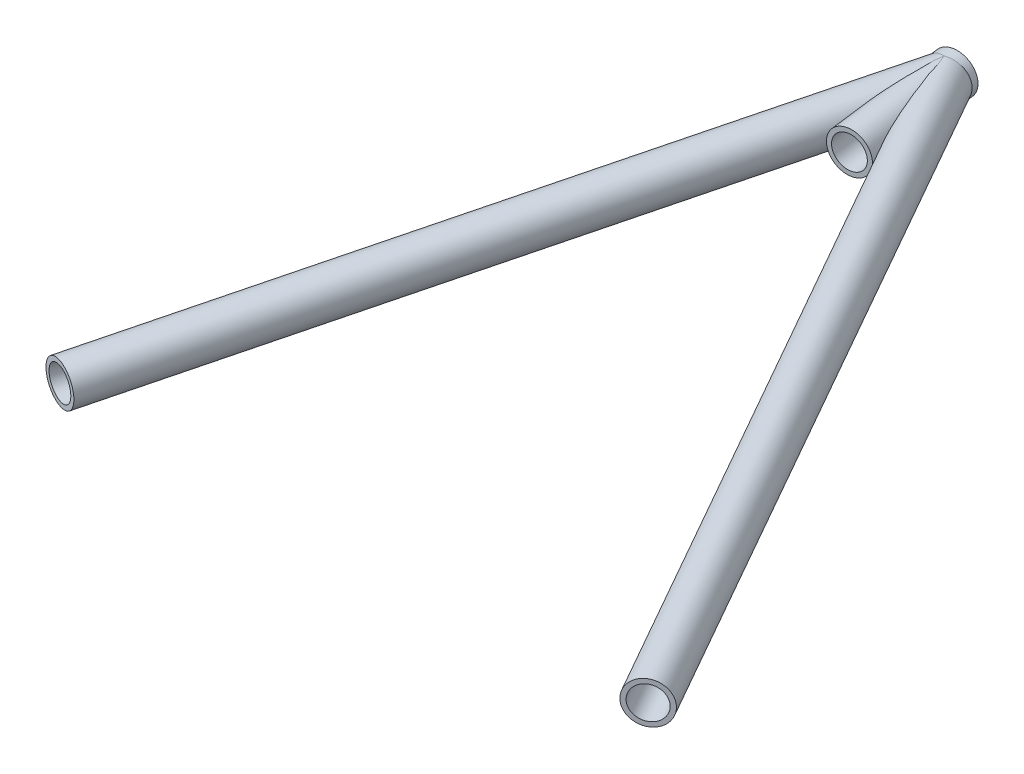
ISO-10303-21;
HEADER;
FILE_DESCRIPTION(('STEP AP214'),'2;1');
FILE_NAME('part.step','',(''),(''),'','','');
FILE_SCHEMA(('AUTOMOTIVE_DESIGN { 1 0 10303 214 1 1 1 1 }'));
ENDSEC;
DATA;
#1=APPLICATION_CONTEXT('core data for automotive mechanical design processes');
#2=APPLICATION_PROTOCOL_DEFINITION('international standard','automotive_design',2000,#1);
#3=PRODUCT_CONTEXT('',#1,'mechanical');
#4=PRODUCT('Part','Part','',(#3));
#5=PRODUCT_RELATED_PRODUCT_CATEGORY('part','',(#4));
#6=PRODUCT_DEFINITION_FORMATION('','',#4);
#7=PRODUCT_DEFINITION_CONTEXT('part definition',#1,'design');
#8=PRODUCT_DEFINITION('design','',#6,#7);
#9=PRODUCT_DEFINITION_SHAPE('','',#8);
#10=(LENGTH_UNIT() NAMED_UNIT(*) SI_UNIT(.MILLI.,.METRE.));
#11=(NAMED_UNIT(*) PLANE_ANGLE_UNIT() SI_UNIT($,.RADIAN.));
#12=(NAMED_UNIT(*) SI_UNIT($,.STERADIAN.) SOLID_ANGLE_UNIT());
#13=UNCERTAINTY_MEASURE_WITH_UNIT(LENGTH_MEASURE(1.E-05),#10,'distance_accuracy_value','');
#14=(GEOMETRIC_REPRESENTATION_CONTEXT(3) GLOBAL_UNCERTAINTY_ASSIGNED_CONTEXT((#13)) GLOBAL_UNIT_ASSIGNED_CONTEXT((#10,
#11,#12)) REPRESENTATION_CONTEXT('',''));
#15=CARTESIAN_POINT('',(0.,0.,0.));
#16=DIRECTION('',(0.,0.,1.));
#17=DIRECTION('',(1.,0.,0.));
#18=AXIS2_PLACEMENT_3D('',#15,#16,#17);
#19=CARTESIAN_POINT('',(3.75423528508093,133.137476358284,-665.631869893479));
#20=DIRECTION('',(0.49375074260803,-0.000241320421330066,0.86960344177014));
#21=DIRECTION('',(0.869603467091057,0.,-0.493750756984952));
#22=AXIS2_PLACEMENT_3D('',#19,#20,#21);
#23=CYLINDRICAL_SURFACE('',#22,7.4168);
#24=CARTESIAN_POINT('',(182.718724008719,133.050007556528,-350.436120461955));
#25=DIRECTION('',(-0.49375074260803,0.000241320421330099,-0.86960344177014));
#26=DIRECTION('',(-0.869603467091057,0.,0.493750756984952));
#27=AXIS2_PLACEMENT_3D('',#24,#25,#26);
#28=CIRCLE('',#27,7.4168);
#29=CARTESIAN_POINT('',(176.269049013998,133.050007556528,-346.774069847549));
#30=VERTEX_POINT('',#29);
#31=EDGE_CURVE('E107',#30,#30,#28,.T.);
#32=ORIENTED_EDGE('',*,*,#31,.F.);
#33=EDGE_LOOP('',(#32));
#34=FACE_BOUND('',#33,.T.);
#35=CARTESIAN_POINT('',(13.6086546072393,133.135812291246,-663.297418366241));
#36=CARTESIAN_POINT('',(13.6102435157583,132.943696286205,-663.294620419258));
#37=CARTESIAN_POINT('',(13.6066690576741,132.751629390176,-663.285786293646));
#38=CARTESIAN_POINT('',(13.5893625437771,132.368906550424,-663.255934631927));
#39=CARTESIAN_POINT('',(13.5756307597827,132.178250569081,-663.234917421853));
#40=CARTESIAN_POINT('',(13.5383840501864,131.799686158064,-663.18052162104));
#41=CARTESIAN_POINT('',(13.5148696740601,131.611777574685,-663.147143724597));
#42=CARTESIAN_POINT('',(13.4586480537573,131.240035038748,-663.067787849124));
#43=CARTESIAN_POINT('',(13.4259407536838,131.056201110973,-663.02180979348));
#44=CARTESIAN_POINT('',(13.3520880992867,130.693630260555,-662.91687980293));
#45=CARTESIAN_POINT('',(13.3109275200954,130.514903206723,-662.857904444888));
#46=CARTESIAN_POINT('',(13.2212805452743,130.16425714513,-662.726738906455));
#47=CARTESIAN_POINT('',(13.1727941403516,129.992338146004,-662.654548709301));
#48=CARTESIAN_POINT('',(13.0698554429603,129.656731838677,-662.496738700705));
#49=CARTESIAN_POINT('',(13.0154057517197,129.493040986401,-662.411124737827));
#50=CARTESIAN_POINT('',(12.9021198522644,129.175119576387,-662.226306344621));
#51=CARTESIAN_POINT('',(12.8432838294249,129.020888619356,-662.127102488481));
#52=CARTESIAN_POINT('',(12.7249114712971,128.7276943423,-661.918441342211));
#53=CARTESIAN_POINT('',(12.6654530788384,128.588406347137,-661.809396079809));
#54=CARTESIAN_POINT('',(12.5459386252434,128.320775840413,-661.578909036197));
#55=CARTESIAN_POINT('',(12.4858825886566,128.192432881314,-661.457467762301));
#56=CARTESIAN_POINT('',(12.3670414906169,127.947432884083,-661.202867662702));
#57=CARTESIAN_POINT('',(12.308255893457,127.830770841963,-661.069713900832));
#58=CARTESIAN_POINT('',(12.193675505941,127.609438879757,-660.792603609228));
#59=CARTESIAN_POINT('',(12.1378806783114,127.504768810198,-660.648647214179));
#60=CARTESIAN_POINT('',(12.0330497537361,127.311585644815,-660.357470136293));
#61=CARTESIAN_POINT('',(11.9838277485131,127.222576941279,-660.210643957389));
#62=CARTESIAN_POINT('',(11.8905270447521,127.055232389319,-659.909497466283));
#63=CARTESIAN_POINT('',(11.8464481329878,126.976896098409,-659.755177465141));
#64=CARTESIAN_POINT('',(11.7641118296804,126.830303226896,-659.440347613243));
#65=CARTESIAN_POINT('',(11.7258543455774,126.76204648603,-659.279837860954));
#66=CARTESIAN_POINT('',(11.6554962190303,126.634828071231,-658.953876245638));
#67=CARTESIAN_POINT('',(11.6233963345776,126.575867541806,-658.788423777063));
#68=CARTESIAN_POINT('',(11.5450717749549,126.427877832954,-658.33609731047));
#69=CARTESIAN_POINT('',(11.5047637170453,126.346819050203,-658.045568590235));
#70=CARTESIAN_POINT('',(11.4412056524005,126.204598993557,-657.457846524422));
#71=CARTESIAN_POINT('',(11.4179684539771,126.143452679151,-657.160648346671));
#72=CARTESIAN_POINT('',(11.3865566881718,126.036870591985,-656.561411265903));
#73=CARTESIAN_POINT('',(11.3784473252225,125.991503510962,-656.259357042143));
#74=CARTESIAN_POINT('',(11.3761141923393,125.933075842372,-655.805129853787));
#75=CARTESIAN_POINT('',(11.3769743384554,125.915205199458,-655.653546370845));
#76=CARTESIAN_POINT('',(11.381710960775,125.88233550764,-655.350111598786));
#77=CARTESIAN_POINT('',(11.3855874493409,125.867336470506,-655.198260308574));
#78=CARTESIAN_POINT('',(11.3993431256962,125.831479250857,-654.801059677835));
#79=CARTESIAN_POINT('',(11.4114472237281,125.812684955806,-654.555600404177));
#80=CARTESIAN_POINT('',(11.4419305208802,125.780748821526,-654.06468918603));
#81=CARTESIAN_POINT('',(11.4603106197901,125.767607793416,-653.819237247642));
#82=CARTESIAN_POINT('',(11.5025320670153,125.746152432103,-653.328474457607));
#83=CARTESIAN_POINT('',(11.5263761840825,125.737840553524,-653.083163740916));
#84=CARTESIAN_POINT('',(11.5788145912336,125.725405955124,-652.592938514377));
#85=CARTESIAN_POINT('',(11.6074091896892,125.721283507379,-652.348024031294));
#86=CARTESIAN_POINT('',(11.6995159018464,125.714388202832,-651.612928002518));
#87=CARTESIAN_POINT('',(11.7692529026552,125.717129458216,-651.12346900276));
#88=CARTESIAN_POINT('',(11.921368028926,125.734329579169,-650.146927999857));
#89=CARTESIAN_POINT('',(12.0037429282855,125.748785458344,-649.659845422728));
#90=CARTESIAN_POINT('',(12.1786900475808,125.787685297371,-648.685884922059));
#91=CARTESIAN_POINT('',(12.2713023908143,125.812169653435,-648.199015893255));
#92=CARTESIAN_POINT('',(12.4643235736586,125.869992358011,-647.22734302503));
#93=CARTESIAN_POINT('',(12.5647328440914,125.903331196027,-646.742539301293));
#94=CARTESIAN_POINT('',(12.771598946191,125.9781577449,-645.775528433244));
#95=CARTESIAN_POINT('',(12.878047704712,126.019634751546,-645.293318723905));
#96=CARTESIAN_POINT('',(13.0958727535896,126.11045505788,-644.330777891784));
#97=CARTESIAN_POINT('',(13.2072489120966,126.159798147176,-643.85044671911));
#98=CARTESIAN_POINT('',(13.4948496122562,126.294898520002,-642.633950000163));
#99=CARTESIAN_POINT('',(13.6737611085542,126.385975395546,-641.899005148523));
#100=CARTESIAN_POINT('',(14.0381924208502,126.587411388771,-640.433154303958));
#101=CARTESIAN_POINT('',(14.2237142358585,126.697776379405,-639.702249611332));
#102=CARTESIAN_POINT('',(14.5050182438505,126.879192564816,-638.610583869734));
#103=CARTESIAN_POINT('',(14.5991387665726,126.942197445056,-638.24804609261));
#104=CARTESIAN_POINT('',(14.7882467543667,127.073947064027,-637.524244307809));
#105=CARTESIAN_POINT('',(14.8832342038424,127.14269169968,-637.162980277378));
#106=CARTESIAN_POINT('',(15.0738266780298,127.286421605985,-636.441937517069));
#107=CARTESIAN_POINT('',(15.1694315728763,127.361405601385,-636.082158499373));
#108=CARTESIAN_POINT('',(15.361041554355,127.518298380359,-635.364228324397));
#109=CARTESIAN_POINT('',(15.4570466304916,127.600206983393,-635.006077124933));
#110=CARTESIAN_POINT('',(15.6695095433893,127.789938554064,-634.216212032073));
#111=CARTESIAN_POINT('',(15.7860037127206,127.899580659242,-633.784940831252));
#112=CARTESIAN_POINT('',(16.018720723797,128.1324063551,-632.925876710485));
#113=CARTESIAN_POINT('',(16.1349435052178,128.255592708991,-632.498084519493));
#114=CARTESIAN_POINT('',(16.3666326044546,128.518727638981,-631.646517396067));
#115=CARTESIAN_POINT('',(16.4820972480334,128.658705094366,-631.222750777843));
#116=CARTESIAN_POINT('',(16.653762249178,128.884588031495,-630.59248495956));
#117=CARTESIAN_POINT('',(16.710718820979,128.962520206554,-630.383329595457));
#118=CARTESIAN_POINT('',(16.8239361408098,129.124552061024,-629.967239242773));
#119=CARTESIAN_POINT('',(16.8801969495779,129.20865119757,-629.760304060589));
#120=CARTESIAN_POINT('',(16.9920135768224,129.384461478673,-629.348379894913));
#121=CARTESIAN_POINT('',(17.0475653934524,129.476203393559,-629.143402887426));
#122=CARTESIAN_POINT('',(17.1573801861085,129.668481490551,-628.737133886553));
#123=CARTESIAN_POINT('',(17.211642701339,129.769020758456,-628.535843216385));
#124=CARTESIAN_POINT('',(17.3181130413428,129.98046060205,-628.139222305527));
#125=CARTESIAN_POINT('',(17.3703279500728,130.091319948049,-627.943872160899));
#126=CARTESIAN_POINT('',(17.4720539341331,130.326435860247,-627.560751266634));
#127=CARTESIAN_POINT('',(17.5215673717822,130.450680429341,-627.372973933643));
#128=CARTESIAN_POINT('',(17.6021038692364,130.676436552347,-627.064124360761));
#129=CARTESIAN_POINT('',(17.6341879406363,130.773448653534,-626.940062923778));
#130=CARTESIAN_POINT('',(17.6955860126308,130.978126094349,-626.699782509526));
#131=CARTESIAN_POINT('',(17.7248951536827,131.085809470916,-626.583577388607));
#132=CARTESIAN_POINT('',(17.7796688606891,131.315154114233,-626.362044988811));
#133=CARTESIAN_POINT('',(17.8050911311566,131.436946835604,-626.256840847838));
#134=CARTESIAN_POINT('',(17.8495158236233,131.695934674998,-626.065686785233));
#135=CARTESIAN_POINT('',(17.8685387687971,131.833078637288,-625.979675614789));
#136=CARTESIAN_POINT('',(17.8917115495539,132.06918836183,-625.863849875242));
#137=CARTESIAN_POINT('',(17.8987614568092,132.163400174659,-625.825030027491));
#138=CARTESIAN_POINT('',(17.9081851545971,132.356888165458,-625.76230046231));
#139=CARTESIAN_POINT('',(17.9105655117314,132.456157029916,-625.738369839166));
#140=CARTESIAN_POINT('',(17.9100284143125,132.658054018629,-625.707766460941));
#141=CARTESIAN_POINT('',(17.9070758689609,132.760699998131,-625.701208721281));
#142=CARTESIAN_POINT('',(17.8957781926082,132.965260004829,-625.706322989759));
#143=CARTESIAN_POINT('',(17.8874304624642,133.067173655285,-625.718003788199));
#144=CARTESIAN_POINT('',(17.866778754469,133.259840862116,-625.75645426341));
#145=CARTESIAN_POINT('',(17.8548038066008,133.350869004817,-625.782074044116));
#146=CARTESIAN_POINT('',(17.8275607639484,133.528119823033,-625.845168348178));
#147=CARTESIAN_POINT('',(17.8122916199545,133.614340956468,-625.882646650282));
#148=CARTESIAN_POINT('',(17.7661235975256,133.847697926776,-626.000401462534));
#149=CARTESIAN_POINT('',(17.7324233318203,133.988998526671,-626.091066180696));
#150=CARTESIAN_POINT('',(17.6601337750247,134.255952832412,-626.291528389755));
#151=CARTESIAN_POINT('',(17.6215261903194,134.381544310314,-626.401398080043));
#152=CARTESIAN_POINT('',(17.5296122700668,134.654552523155,-626.667403026716));
#153=CARTESIAN_POINT('',(17.4753164567288,134.797563661048,-626.827655410108));
#154=CARTESIAN_POINT('',(17.3639206150107,135.067085956773,-627.160745879943));
#155=CARTESIAN_POINT('',(17.3068152181757,135.193563692967,-627.333608391557));
#156=CARTESIAN_POINT('',(17.1906783077242,135.434160532985,-627.688378364864));
#157=CARTESIAN_POINT('',(17.1316385753243,135.548214522415,-627.870326815258));
#158=CARTESIAN_POINT('',(17.0125987828536,135.76581525633,-628.239779192347));
#159=CARTESIAN_POINT('',(16.9525996845245,135.869371842787,-628.427277698333));
#160=CARTESIAN_POINT('',(16.8379452532912,136.058167503616,-628.787669785946));
#161=CARTESIAN_POINT('',(16.7833500823083,136.144204668453,-628.960167642796));
#162=CARTESIAN_POINT('',(16.6738167086596,136.310444558941,-629.307852852936));
#163=CARTESIAN_POINT('',(16.618878472766,136.390646709616,-629.483040469218));
#164=CARTESIAN_POINT('',(16.4537000312348,136.623820484157,-630.011977159066));
#165=CARTESIAN_POINT('',(16.3431459408628,136.769279390334,-630.368943134666));
#166=CARTESIAN_POINT('',(16.1216677789608,137.045002209726,-631.089425612174));
#167=CARTESIAN_POINT('',(16.0107434203679,137.175233188439,-631.452954418302));
#168=CARTESIAN_POINT('',(15.7891462248987,137.423135381394,-632.184369923435));
#169=CARTESIAN_POINT('',(15.678473416169,137.540805251908,-632.552257084008));
#170=CARTESIAN_POINT('',(15.4574366681595,137.765918076101,-633.292223000904));
#171=CARTESIAN_POINT('',(15.3470740340911,137.873336762449,-633.664309480258));
#172=CARTESIAN_POINT('',(15.127150616958,138.079163288941,-634.411214893228));
#173=CARTESIAN_POINT('',(15.0175898788865,138.177570626984,-634.786033977847));
#174=CARTESIAN_POINT('',(14.7996448261579,138.366370144409,-635.53742290969));
#175=CARTESIAN_POINT('',(14.6912590923869,138.456773235393,-635.913989613348));
#176=CARTESIAN_POINT('',(14.475720802885,138.63057209485,-636.669087842408));
#177=CARTESIAN_POINT('',(14.3685682662606,138.713967754879,-637.047619398122));
#178=CARTESIAN_POINT('',(14.1004479556874,138.916082852716,-638.003447086399));
#179=CARTESIAN_POINT('',(13.9404283025361,139.030657946074,-638.581887926304));
#180=CARTESIAN_POINT('',(13.6245897120992,139.246869276464,-639.742338218555));
#181=CARTESIAN_POINT('',(13.4687709695469,139.348504914496,-640.324347834803));
#182=CARTESIAN_POINT('',(13.1622245357466,139.540008510908,-641.492303742559));
#183=CARTESIAN_POINT('',(13.0115023639876,139.629863996537,-642.07825352696));
#184=CARTESIAN_POINT('',(12.7166647284632,139.798281245158,-643.253408916733));
#185=CARTESIAN_POINT('',(12.5725490108277,139.87684344237,-643.842614396019));
#186=CARTESIAN_POINT('',(12.2932562085905,140.022508656525,-645.022019427297));
#187=CARTESIAN_POINT('',(12.1580455296245,140.089656455896,-645.612205468665));
#188=CARTESIAN_POINT('',(11.8982859376156,140.212476076049,-646.796220397976));
#189=CARTESIAN_POINT('',(11.7737383002559,140.268146524846,-647.390049712704));
#190=CARTESIAN_POINT('',(11.5975413384035,140.342103950557,-648.28331266253));
#191=CARTESIAN_POINT('',(11.5406092287809,140.365154616146,-648.58131604653));
#192=CARTESIAN_POINT('',(11.4308193625709,140.407828317647,-649.178313994406));
#193=CARTESIAN_POINT('',(11.3779614859032,140.427451454601,-649.477308528797));
#194=CARTESIAN_POINT('',(11.2769872451166,140.46292724638,-650.07625310869));
#195=CARTESIAN_POINT('',(11.2288697923269,140.478780768112,-650.376202918395));
#196=CARTESIAN_POINT('',(11.138166163339,140.506257882043,-650.977122398926));
#197=CARTESIAN_POINT('',(11.0955796245221,140.517881751639,-651.278092001564));
#198=CARTESIAN_POINT('',(11.0326765117404,140.532583571745,-651.760235850056));
#199=CARTESIAN_POINT('',(11.0102738042889,140.537219555616,-651.941091074691));
#200=CARTESIAN_POINT('',(10.9680587612226,140.544566841023,-652.303140083969));
#201=CARTESIAN_POINT('',(10.9482464129427,140.547278151971,-652.484333866953));
#202=CARTESIAN_POINT('',(10.893092793489,140.552230473486,-653.028458797582));
#203=CARTESIAN_POINT('',(10.8620418455926,140.551288185937,-653.39188180954));
#204=CARTESIAN_POINT('',(10.8140302824725,140.53875698168,-654.119473256322));
#205=CARTESIAN_POINT('',(10.7970679636685,140.527169352551,-654.483641595682));
#206=CARTESIAN_POINT('',(10.7805385956098,140.490241292133,-655.211696267821));
#207=CARTESIAN_POINT('',(10.7809656123947,140.464905555179,-655.575582654428));
#208=CARTESIAN_POINT('',(10.7996604814402,140.406767632614,-656.187954070913));
#209=CARTESIAN_POINT('',(10.8123261006012,140.378753968375,-656.43705712924));
#210=CARTESIAN_POINT('',(10.8491044125988,140.312185179117,-656.933074581053));
#211=CARTESIAN_POINT('',(10.8732176516205,140.273629551161,-657.179988869539));
#212=CARTESIAN_POINT('',(10.9340712879515,140.183815500964,-657.669450968339));
#213=CARTESIAN_POINT('',(10.9707856437523,140.132583336557,-657.912006706637));
#214=CARTESIAN_POINT('',(11.0577228384679,140.014838925864,-658.390928758306));
#215=CARTESIAN_POINT('',(11.1079406428072,139.94833237577,-658.627297342504));
#216=CARTESIAN_POINT('',(11.2079646428968,139.815981680827,-659.033981779209));
#217=CARTESIAN_POINT('',(11.2548463566336,139.753981820254,-659.206269867957));
#218=CARTESIAN_POINT('',(11.3559441635559,139.61881791541,-659.544169100685));
#219=CARTESIAN_POINT('',(11.4101582360909,139.545656946208,-659.709782067929));
#220=CARTESIAN_POINT('',(11.5250837093319,139.387408826185,-660.032782110745));
#221=CARTESIAN_POINT('',(11.5857922978034,139.302326832465,-660.190172703153));
#222=CARTESIAN_POINT('',(11.7124551559932,139.119744864638,-660.495370043563));
#223=CARTESIAN_POINT('',(11.7784094849009,139.022244750406,-660.643176683391));
#224=CARTESIAN_POINT('',(11.914180215819,138.814333549254,-660.928533707605));
#225=CARTESIAN_POINT('',(11.9840107072782,138.703873481699,-661.066041740377));
#226=CARTESIAN_POINT('',(12.1253851317037,138.470641916315,-661.329234252082));
#227=CARTESIAN_POINT('',(12.1969291113969,138.347870082454,-661.454918408115));
#228=CARTESIAN_POINT('',(12.3397752932093,138.090564224781,-661.693947979671));
#229=CARTESIAN_POINT('',(12.4110773161115,137.956022891981,-661.80728562838));
#230=CARTESIAN_POINT('',(12.5514541023836,137.676121743778,-662.021255812637));
#231=CARTESIAN_POINT('',(12.6205288998249,137.530762093985,-662.121888542609));
#232=CARTESIAN_POINT('',(12.7509818324116,137.238551393358,-662.305219209714));
#233=CARTESIAN_POINT('',(12.8125743366183,137.092222795274,-662.388599426097));
#234=CARTESIAN_POINT('',(12.9308698929848,136.791817132092,-662.544076718907));
#235=CARTESIAN_POINT('',(12.9875732247804,136.637740510939,-662.616174440829));
#236=CARTESIAN_POINT('',(13.0949800311171,136.322819654164,-662.749263467112));
#237=CARTESIAN_POINT('',(13.145682539886,136.161974334818,-662.810252984569));
#238=CARTESIAN_POINT('',(13.2401521948778,135.834570545958,-662.921298120616));
#239=CARTESIAN_POINT('',(13.2839188746257,135.668011693091,-662.971353003873));
#240=CARTESIAN_POINT('',(13.3685639704998,135.309949024613,-663.066064084194));
#241=CARTESIAN_POINT('',(13.4084656070514,135.117850202321,-663.109351716526));
#242=CARTESIAN_POINT('',(13.4778467722152,134.729273212127,-663.182623860937));
#243=CARTESIAN_POINT('',(13.5073253133268,134.532794631153,-663.212607112607));
#244=CARTESIAN_POINT('',(13.555337457324,134.136917436385,-663.259398394504));
#245=CARTESIAN_POINT('',(13.5738691228693,133.937518312119,-663.276204092784));
#246=CARTESIAN_POINT('',(13.599697300863,133.537332300061,-663.296675441438));
#247=CARTESIAN_POINT('',(13.6069944296405,133.336545489005,-663.300341812651));
#248=CARTESIAN_POINT('',(13.6086546072393,133.135812291246,-663.297418366241));
#249=B_SPLINE_CURVE_WITH_KNOTS('',3,(#35,#36,#37,#38,#39,#40,#41,#42,#43,#44,#45,#46,#47,#48,
#49,#50,#51,#52,#53,#54,#55,#56,#57,#58,#59,#60,#61,#62,#63,#64,#65,#66,#67,#68,#69,#70,#71,#72,
#73,#74,#75,#76,#77,#78,#79,#80,#81,#82,#83,#84,#85,#86,#87,#88,#89,#90,#91,#92,#93,#94,#95,#96,
#97,#98,#99,#100,#101,#102,#103,#104,#105,#106,#107,#108,#109,#110,#111,#112,#113,#114,#115,
#116,#117,#118,#119,#120,#121,#122,#123,#124,#125,#126,#127,#128,#129,#130,#131,#132,#133,#134,
#135,#136,#137,#138,#139,#140,#141,#142,#143,#144,#145,#146,#147,#148,#149,#150,#151,#152,#153,
#154,#155,#156,#157,#158,#159,#160,#161,#162,#163,#164,#165,#166,#167,#168,#169,#170,#171,#172,
#173,#174,#175,#176,#177,#178,#179,#180,#181,#182,#183,#184,#185,#186,#187,#188,#189,#190,#191,
#192,#193,#194,#195,#196,#197,#198,#199,#200,#201,#202,#203,#204,#205,#206,#207,#208,#209,#210,
#211,#212,#213,#214,#215,#216,#217,#218,#219,#220,#221,#222,#223,#224,#225,#226,#227,#228,#229,
#230,#231,#232,#233,#234,#235,#236,#237,#238,#239,#240,#241,#242,#243,#244,#245,#246,#247,#248),
.UNSPECIFIED.,.T.,.F.,(4,2,2,2,2,2,2,2,2,2,2,2,2,2,2,2,2,2,2,2,2,2,2,2,2,2,2,2,2,2,2,2,2,2,2,2,
2,2,2,2,2,2,2,2,2,2,2,2,2,2,2,2,2,2,2,2,2,2,2,2,2,2,2,2,2,2,2,2,2,2,2,2,2,2,2,2,2,2,2,2,2,2,2,2,
2,2,2,2,2,2,2,2,2,2,2,2,2,2,2,2,2,2,2,2,2,2,4),(0.,0.576257522450247,1.15249962433111,
1.72870936380165,2.3049226069419,2.88218289228343,3.45944390988877,4.03645411755667,
4.61343995340236,5.17258017470829,5.73169752209311,6.29057431511023,6.84944414130359,
7.38471560797734,7.91996487506497,8.45520563087696,8.990512231804,9.90183350984317,
10.81383785828,11.7297641518732,12.1876276741563,12.6454930729813,13.384736498608,
14.1240859540465,14.8638108876773,15.6035838584319,17.0863677439679,18.5687737440807,
20.0572107613525,21.545730081357,23.0323045059726,24.5188391761482,26.8041635940289,
29.0901850766531,30.2296022051011,31.3689988754548,32.5081632358964,33.6472979050552,
35.0270711805351,36.4071264725146,37.7895903254869,38.4805820592335,39.171513039174,
39.8653742989993,40.5594799238148,41.2509226920134,41.9417508000338,42.4235107461619,
42.9060993366719,43.3936137522666,43.8795494209243,44.1848867715463,44.489794429776,
44.7967157116883,45.1037849639774,45.3886913410789,45.6736885958934,46.184389621879,
46.6970535805094,47.3601110624247,48.0244888187825,48.6921962312096,49.35927172077,
49.9601902134685,50.5611678401415,51.7636715310591,52.9687296528557,54.1739165569493,
55.3818891494722,56.589929007742,57.7962958282865,59.0026813145072,60.8355067240752,
62.6684169487228,64.503252437806,66.3380173593834,68.165408877834,69.9930187134273,
70.9057825505669,71.818519475434,72.7310462929807,73.6435132530691,74.190375795066,
74.7372356631819,75.8311119120261,76.9248558714026,78.0182266032507,78.7708083476697,
79.523426002626,80.2744975683907,81.0252894947685,81.5917963080054,82.1581473202686,
82.7242540781492,83.2903672244928,83.8586933757519,84.4270350429442,84.9957321967822,
85.5644206467227,86.1018080526181,86.6391647022671,87.1766077168023,87.7140868621947,
88.3160614080905,88.9180929707451,89.5202310469822,90.1223360886182),.UNSPECIFIED.);
#250=CARTESIAN_POINT('',(13.6086546072393,133.135812291246,-663.297418366241));
#251=VERTEX_POINT('',#250);
#252=EDGE_CURVE('E81',#251,#251,#249,.T.);
#253=ORIENTED_EDGE('',*,*,#252,.T.);
#254=EDGE_LOOP('',(#253));
#255=FACE_BOUND('',#254,.T.);
#256=ADVANCED_FACE('F63',(#34,#255),#23,.F.);
#257=CARTESIAN_POINT('',(9.44247056550694,132.205085243906,-615.965234954071));
#258=DIRECTION('',(-0.113764705608517,0.018647822287539,-0.993332698788145));
#259=DIRECTION('',(-0.99350545523548,0.,0.113784491110793));
#260=AXIS2_PLACEMENT_3D('',#257,#258,#259);
#261=CYLINDRICAL_SURFACE('',#260,9.525);
#262=ORIENTED_EDGE('',*,*,#252,.F.);
#263=EDGE_LOOP('',(#262));
#264=FACE_BOUND('',#263,.T.);
#265=CARTESIAN_POINT('',(3.75423528508111,133.137476358283,-665.631869893478));
#266=DIRECTION('',(0.949854925607184,0.0460109181876038,-0.309287270522575));
#267=DIRECTION('',(0.310022927269246,-0.0096393718602572,0.950680212835813));
#268=AXIS2_PLACEMENT_3D('',#265,#266,#267);
#269=ELLIPSE('',#268,47.6194769568337,9.52499999999999);
#270=CARTESIAN_POINT('',(4.14247747103312,123.623006933356,-665.854949626237));
#271=VERTEX_POINT('',#270);
#272=CARTESIAN_POINT('',(3.36599309912909,142.651945783211,-665.40879016072));
#273=VERTEX_POINT('',#272);
#274=EDGE_CURVE('E72',#271,#273,#269,.F.);
#275=ORIENTED_EDGE('',*,*,#274,.T.);
#276=CARTESIAN_POINT('',(3.75423528508111,133.137476358283,-665.631869893478));
#277=DIRECTION('',(0.310022927269246,-0.0096393718602572,0.950680212835813));
#278=DIRECTION('',(0.949854925607184,0.0460109181876038,-0.309287270522575));
#279=AXIS2_PLACEMENT_3D('',#276,#277,#278);
#280=ELLIPSE('',#279,9.72145939962004,9.52499999999999);
#281=EDGE_CURVE('E13',#273,#271,#280,.F.);
#282=ORIENTED_EDGE('',*,*,#281,.T.);
#283=EDGE_LOOP('',(#275,#282));
#284=FACE_BOUND('',#283,.T.);
#285=ADVANCED_FACE('F79',(#264,#284),#261,.F.);
#286=CARTESIAN_POINT('',(3.75423528508093,133.137476358284,-665.631869893479));
#287=DIRECTION('',(0.49375074260803,-0.000241320421330066,0.86960344177014));
#288=DIRECTION('',(0.869603467091057,0.,-0.493750756984952));
#289=AXIS2_PLACEMENT_3D('',#286,#287,#288);
#290=CYLINDRICAL_SURFACE('',#289,9.52499999999998);
#291=CARTESIAN_POINT('',(182.718724008719,133.050007556528,-350.436120461955));
#292=DIRECTION('',(-0.49375074260803,0.000241320421330099,-0.86960344177014));
#293=DIRECTION('',(-0.869603467091057,0.,0.493750756984952));
#294=AXIS2_PLACEMENT_3D('',#291,#292,#293);
#295=CIRCLE('',#294,9.52499999999998);
#296=CARTESIAN_POINT('',(174.435750984677,133.050007556528,-345.733144501674));
#297=VERTEX_POINT('',#296);
#298=EDGE_CURVE('E67',#297,#297,#295,.T.);
#299=ORIENTED_EDGE('',*,*,#298,.T.);
#300=EDGE_LOOP('',(#299));
#301=FACE_BOUND('',#300,.T.);
#302=ORIENTED_EDGE('',*,*,#274,.F.);
#303=ORIENTED_EDGE('',*,*,#281,.F.);
#304=EDGE_LOOP('',(#302,#303));
#305=FACE_BOUND('',#304,.T.);
#306=ADVANCED_FACE('F65',(#301,#305),#290,.T.);
#307=CARTESIAN_POINT('',(182.718724008719,133.050007556528,-350.436120461955));
#308=DIRECTION('',(-0.49375074260803,0.000241320421330099,-0.86960344177014));
#309=DIRECTION('',(-0.869603467091057,0.,0.493750756984952));
#310=AXIS2_PLACEMENT_3D('',#307,#308,#309);
#311=PLANE('',#310);
#312=ORIENTED_EDGE('',*,*,#31,.T.);
#313=EDGE_LOOP('',(#312));
#314=FACE_BOUND('',#313,.T.);
#315=ORIENTED_EDGE('',*,*,#298,.F.);
#316=EDGE_LOOP('',(#315));
#317=FACE_BOUND('',#316,.T.);
#318=ADVANCED_FACE('F84',(#314,#317),#311,.F.);
#319=CLOSED_SHELL('',(#256,#285,#306,#318));
#320=MANIFOLD_SOLID_BREP('B2',#319);
#321=CARTESIAN_POINT('',(-99.9999999999999,120.799926986381,-320.));
#322=DIRECTION('',(0.28734441952249,0.0341684939690268,-0.957217686103413));
#323=DIRECTION('',(-0.95777694496046,0.,-0.287512301827606));
#324=AXIS2_PLACEMENT_3D('',#321,#322,#323);
#325=CYLINDRICAL_SURFACE('',#324,7.4168);
#326=CARTESIAN_POINT('',(-89.9429453167127,121.995824275297,-353.50261901362));
#327=DIRECTION('',(0.28734441952249,0.0341684939690268,-0.957217686103413));
#328=DIRECTION('',(-0.95777694496046,0.,-0.287512301827606));
#329=AXIS2_PLACEMENT_3D('',#326,#327,#328);
#330=CIRCLE('',#329,7.4168);
#331=CARTESIAN_POINT('',(-97.0465853620954,121.995824275297,-355.635040253815));
#332=VERTEX_POINT('',#331);
#333=EDGE_CURVE('E189',#332,#332,#330,.T.);
#334=ORIENTED_EDGE('',*,*,#333,.F.);
#335=EDGE_LOOP('',(#334));
#336=FACE_BOUND('',#335,.T.);
#337=CARTESIAN_POINT('',(-5.32280045840875,132.90281734134,-661.190405804536));
#338=CARTESIAN_POINT('',(-5.32532446511033,133.095076571401,-661.181993459531));
#339=CARTESIAN_POINT('',(-5.32143391096337,133.287263711764,-661.168877389668));
#340=CARTESIAN_POINT('',(-5.30091999978784,133.670150425419,-661.133159242241));
#341=CARTESIAN_POINT('',(-5.28428976515265,133.860849138979,-661.110552043804));
#342=CARTESIAN_POINT('',(-5.23853391932889,134.239762989633,-661.055598658993));
#343=CARTESIAN_POINT('',(-5.20938111917786,134.42797179876,-661.023231327276));
#344=CARTESIAN_POINT('',(-5.13906854033556,134.800106487093,-660.948475187571));
#345=CARTESIAN_POINT('',(-5.09790894283656,134.984032430886,-660.906086530814));
#346=CARTESIAN_POINT('',(-5.00425602719279,135.346367333121,-660.81085344079));
#347=CARTESIAN_POINT('',(-4.95175423348311,135.524772051175,-660.758001190984));
#348=CARTESIAN_POINT('',(-4.83638164170908,135.874539137095,-660.641386172527));
#349=CARTESIAN_POINT('',(-4.77351046030474,136.045901244316,-660.577623000514));
#350=CARTESIAN_POINT('',(-4.63867773993233,136.380034614311,-660.438749195182));
#351=CARTESIAN_POINT('',(-4.56672502794871,136.542814004303,-660.363649566861));
#352=CARTESIAN_POINT('',(-4.41517183996874,136.858615779354,-660.201585548859));
#353=CARTESIAN_POINT('',(-4.33557174213389,137.011638646248,-660.114621745768));
#354=CARTESIAN_POINT('',(-4.17294225291962,137.302301772491,-659.931238933771));
#355=CARTESIAN_POINT('',(-4.09008503812704,137.440264001794,-659.835177655319));
#356=CARTESIAN_POINT('',(-3.92065993967033,137.704852416657,-659.631420456186));
#357=CARTESIAN_POINT('',(-3.834092196095,137.831479029629,-659.523724974515));
#358=CARTESIAN_POINT('',(-3.65923815414095,138.072608523466,-659.296895159342));
#359=CARTESIAN_POINT('',(-3.57095255229404,138.187116201678,-659.177765388047));
#360=CARTESIAN_POINT('',(-3.39459612414685,138.403647505513,-658.92852133138));
#361=CARTESIAN_POINT('',(-3.30652529345782,138.50567138837,-658.798407272437));
#362=CARTESIAN_POINT('',(-3.13653424274035,138.692679424399,-658.534417106523));
#363=CARTESIAN_POINT('',(-3.05451998493761,138.778240776469,-658.401008910785));
#364=CARTESIAN_POINT('',(-2.89367346394761,138.938309961299,-658.125932283249));
#365=CARTESIAN_POINT('',(-2.81484105255959,139.01281830931,-657.984264236922));
#366=CARTESIAN_POINT('',(-2.66137702599043,139.151370913785,-657.693751340935));
#367=CARTESIAN_POINT('',(-2.58674524433827,139.215415585118,-657.544906776115));
#368=CARTESIAN_POINT('',(-2.44234730812666,139.333842948193,-657.241152286654));
#369=CARTESIAN_POINT('',(-2.37258177575441,139.38822440579,-657.086241590351));
#370=CARTESIAN_POINT('',(-2.19403094692563,139.521209155885,-656.667630678681));
#371=CARTESIAN_POINT('',(-2.08983304736065,139.592154597709,-656.399519386958));
#372=CARTESIAN_POINT('',(-1.89603637356109,139.714279775661,-655.85368896055));
#373=CARTESIAN_POINT('',(-1.80644804536858,139.765445404468,-655.575963121849));
#374=CARTESIAN_POINT('',(-1.64051381270443,139.852066418455,-655.012962870519));
#375=CARTESIAN_POINT('',(-1.56422470910485,139.887455376685,-654.727661801411));
#376=CARTESIAN_POINT('',(-1.45894149654571,139.93092894018,-654.296646151515));
#377=CARTESIAN_POINT('',(-1.42537500570984,139.943817690466,-654.152477863489));
#378=CARTESIAN_POINT('',(-1.36107642133819,139.966724846219,-653.863279404013));
#379=CARTESIAN_POINT('',(-1.33034434753158,139.976743231708,-653.718249226571));
#380=CARTESIAN_POINT('',(-1.25455445221917,139.9992465492,-653.343679031132));
#381=CARTESIAN_POINT('',(-1.21145367232595,140.009822968237,-653.113627881069));
#382=CARTESIAN_POINT('',(-1.13105159484138,140.025564962667,-652.652316161552));
#383=CARTESIAN_POINT('',(-1.09375110610913,140.030729783978,-652.421055428059));
#384=CARTESIAN_POINT('',(-1.02425813276692,140.036425177062,-651.957601227509));
#385=CARTESIAN_POINT('',(-0.992068188071652,140.036953451529,-651.725407355096));
#386=CARTESIAN_POINT('',(-0.932215971866535,140.033986602298,-651.260457055852));
#387=CARTESIAN_POINT('',(-0.904553994322714,140.030491217492,-651.027700593492));
#388=CARTESIAN_POINT('',(-0.827432808274786,140.014716511437,-650.32788048655));
#389=CARTESIAN_POINT('',(-0.783983515054542,139.997140966856,-649.860268010838));
#390=CARTESIAN_POINT('',(-0.709605477469021,139.950776902994,-648.924790175834));
#391=CARTESIAN_POINT('',(-0.678673664948811,139.921991134846,-648.456924906692));
#392=CARTESIAN_POINT('',(-0.626596907064288,139.854854115776,-647.51934763648));
#393=CARTESIAN_POINT('',(-0.605494149567917,139.816462699057,-647.049636245034));
#394=CARTESIAN_POINT('',(-0.571262345540276,139.731333486059,-646.110672071733));
#395=CARTESIAN_POINT('',(-0.558133710689445,139.684595259019,-645.641419314804));
#396=CARTESIAN_POINT('',(-0.538329411456542,139.583539062546,-644.704218581762));
#397=CARTESIAN_POINT('',(-0.531645402177449,139.529230999637,-644.236269702765));
#398=CARTESIAN_POINT('',(-0.523511960907571,139.413369523185,-643.301239295846));
#399=CARTESIAN_POINT('',(-0.522062413580554,139.351816269314,-642.834157749041));
#400=CARTESIAN_POINT('',(-0.523386671102324,139.22858982308,-641.951104402073));
#401=CARTESIAN_POINT('',(-0.525723646234277,139.1676393841,-641.535030609017));
#402=CARTESIAN_POINT('',(-0.533283417940708,139.040030771204,-640.703780416362));
#403=CARTESIAN_POINT('',(-0.538506249156633,138.97337252878,-640.288604027595));
#404=CARTESIAN_POINT('',(-0.55138921295042,138.834170227163,-639.459123459089));
#405=CARTESIAN_POINT('',(-0.55905022077207,138.761624061331,-639.044819646427));
#406=CARTESIAN_POINT('',(-0.576427800112162,138.610396757856,-638.217376754923));
#407=CARTESIAN_POINT('',(-0.586144364170691,138.531715642477,-637.804237671861));
#408=CARTESIAN_POINT('',(-0.607278678773326,138.368024454563,-636.980311661453));
#409=CARTESIAN_POINT('',(-0.618692194092135,138.283030394794,-636.569521449518));
#410=CARTESIAN_POINT('',(-0.642950441086956,138.106010187941,-635.749508106921));
#411=CARTESIAN_POINT('',(-0.655795138765475,138.013984207916,-635.340284939274));
#412=CARTESIAN_POINT('',(-0.682652026157147,137.82220965312,-634.523798676128));
#413=CARTESIAN_POINT('',(-0.696663908063554,137.722463114882,-634.116535093633));
#414=CARTESIAN_POINT('',(-0.725612367668741,137.514284512831,-633.304278327131));
#415=CARTESIAN_POINT('',(-0.740548904233738,137.40585283532,-632.899285043001));
#416=CARTESIAN_POINT('',(-0.771142325872506,137.178756908608,-632.091117771599));
#417=CARTESIAN_POINT('',(-0.786800885730658,137.060068246658,-631.687950670148));
#418=CARTESIAN_POINT('',(-0.818547813997315,136.810923878471,-630.88520160083));
#419=CARTESIAN_POINT('',(-0.834636248269107,136.680466361706,-630.48562019502));
#420=CARTESIAN_POINT('',(-0.866915583786615,136.405610434468,-629.692055395611));
#421=CARTESIAN_POINT('',(-0.883106237941042,136.261238480292,-629.298062950765));
#422=CARTESIAN_POINT('',(-0.907199453998482,136.031376992929,-628.712355363967));
#423=CARTESIAN_POINT('',(-0.915197343083074,135.952550654569,-628.518025285804));
#424=CARTESIAN_POINT('',(-0.931065797626531,135.789809365158,-628.131507591958));
#425=CARTESIAN_POINT('',(-0.938936369649505,135.705894677513,-627.93931986598));
#426=CARTESIAN_POINT('',(-0.957977379490109,135.493051888895,-627.471549334827));
#427=CARTESIAN_POINT('',(-0.969036169058006,135.360883041365,-627.197422978259));
#428=CARTESIAN_POINT('',(-0.990439730352056,135.080522878081,-626.656339217076));
#429=CARTESIAN_POINT('',(-1.00078246948724,134.932288788205,-626.389403436832));
#430=CARTESIAN_POINT('',(-1.01574831990034,134.687461461471,-625.987239666067));
#431=CARTESIAN_POINT('',(-1.02082554606325,134.598219806494,-625.84756099351));
#432=CARTESIAN_POINT('',(-1.03046904634924,134.412302212938,-625.573066530571));
#433=CARTESIAN_POINT('',(-1.03503505261665,134.315622421459,-625.438253314299));
#434=CARTESIAN_POINT('',(-1.04344936159375,134.113793678459,-625.175972268028));
#435=CARTESIAN_POINT('',(-1.04730071079703,134.008683546702,-625.048474937539));
#436=CARTESIAN_POINT('',(-1.05403781077358,133.787792627936,-624.80316301458));
#437=CARTESIAN_POINT('',(-1.0569248835489,133.672026729999,-624.685335333899));
#438=CARTESIAN_POINT('',(-1.06080218938585,133.456826337527,-624.490555848051));
#439=CARTESIAN_POINT('',(-1.06208157781466,133.360156542491,-624.410587162082));
#440=CARTESIAN_POINT('',(-1.06359836955809,133.158143298763,-624.262015058032));
#441=CARTESIAN_POINT('',(-1.06383489897855,133.052792650965,-624.193421218133));
#442=CARTESIAN_POINT('',(-1.06293671501514,132.831522062935,-624.071421519905));
#443=CARTESIAN_POINT('',(-1.0617833178526,132.715477915597,-624.018234795422));
#444=CARTESIAN_POINT('',(-1.05771818728032,132.475535559523,-623.934578189387));
#445=CARTESIAN_POINT('',(-1.0548120856929,132.351663639631,-623.904036243028));
#446=CARTESIAN_POINT('',(-1.0479947427224,132.130175453406,-623.874669534641));
#447=CARTESIAN_POINT('',(-1.04448642226449,132.033314417172,-623.870032693644));
#448=CARTESIAN_POINT('',(-1.03641729710481,131.840273857986,-623.877546003608));
#449=CARTESIAN_POINT('',(-1.03185643125086,131.744094374966,-623.889697130143));
#450=CARTESIAN_POINT('',(-1.02188972363897,131.555594585563,-623.929528395147));
#451=CARTESIAN_POINT('',(-1.01648780864946,131.463258752483,-623.957137841948));
#452=CARTESIAN_POINT('',(-1.00504878201533,131.283640828459,-624.025412617137));
#453=CARTESIAN_POINT('',(-0.999011219129052,131.196362396804,-624.066087263));
#454=CARTESIAN_POINT('',(-0.982234629382675,130.969874681172,-624.189113689551));
#455=CARTESIAN_POINT('',(-0.971099800623823,130.835889061578,-624.280961213654));
#456=CARTESIAN_POINT('',(-0.948260844898525,130.583136192785,-624.483576093222));
#457=CARTESIAN_POINT('',(-0.936554879733624,130.464423259865,-624.594407875944));
#458=CARTESIAN_POINT('',(-0.910131955921944,130.213274185957,-624.855946608812));
#459=CARTESIAN_POINT('',(-0.895358857464316,130.084252848155,-625.009878896246));
#460=CARTESIAN_POINT('',(-0.865777499563243,129.841364801824,-625.329406284804));
#461=CARTESIAN_POINT('',(-0.850969225920806,129.727526799239,-625.495022597264));
#462=CARTESIAN_POINT('',(-0.821398770568286,129.511358763118,-625.834693886684));
#463=CARTESIAN_POINT('',(-0.806637191230318,129.409089226396,-626.008786976082));
#464=CARTESIAN_POINT('',(-0.777316266441513,129.214385401353,-626.36214782081));
#465=CARTESIAN_POINT('',(-0.762756756278035,129.121942636934,-626.541410944204));
#466=CARTESIAN_POINT('',(-0.735759652519429,128.956654756235,-626.880017745236));
#467=CARTESIAN_POINT('',(-0.723294526433568,128.882830356118,-627.038885229046));
#468=CARTESIAN_POINT('',(-0.698546217543386,128.740337940274,-627.358936303045));
#469=CARTESIAN_POINT('',(-0.686263051480536,128.671670396675,-627.520120103694));
#470=CARTESIAN_POINT('',(-0.649690618282901,128.472284235355,-628.006576742272));
#471=CARTESIAN_POINT('',(-0.625689600589376,128.348249120995,-628.334613870192));
#472=CARTESIAN_POINT('',(-0.578468854939131,128.113829262201,-628.996269685982));
#473=CARTESIAN_POINT('',(-0.555250847047413,128.003473304759,-629.32989852185));
#474=CARTESIAN_POINT('',(-0.509690047491521,127.794069835505,-630.000766015531));
#475=CARTESIAN_POINT('',(-0.487347351561955,127.695023558399,-630.338005063092));
#476=CARTESIAN_POINT('',(-0.443543179344292,127.506181910764,-631.015888755279));
#477=CARTESIAN_POINT('',(-0.422083708430885,127.416406961517,-631.356539177983));
#478=CARTESIAN_POINT('',(-0.380154116686574,127.244973329703,-632.039945915842));
#479=CARTESIAN_POINT('',(-0.359684047662586,127.163315071904,-632.382702340215));
#480=CARTESIAN_POINT('',(-0.319829102159531,127.007185249696,-633.069426517199));
#481=CARTESIAN_POINT('',(-0.300442826813303,126.932704327071,-633.413392069367));
#482=CARTESIAN_POINT('',(-0.262806921409427,126.790013941393,-634.102683959706));
#483=CARTESIAN_POINT('',(-0.244557312954321,126.72180459752,-634.448010323608));
#484=CARTESIAN_POINT('',(-0.196986649189875,126.545409939504,-635.381042702083));
#485=CARTESIAN_POINT('',(-0.168821323116318,126.442523797525,-635.969813160118));
#486=CARTESIAN_POINT('',(-0.116597120300866,126.250728506327,-637.149820007428));
#487=CARTESIAN_POINT('',(-0.0925384875542552,126.161820187612,-637.741056541086));
#488=CARTESIAN_POINT('',(-0.0492543936739678,125.996419476191,-638.925958896577));
#489=CARTESIAN_POINT('',(-0.0300331365793819,125.919937903565,-639.519626378907));
#490=CARTESIAN_POINT('',(0.00257051137915946,125.778512828081,-640.708472395703));
#491=CARTESIAN_POINT('',(0.0159530924046547,125.713568949491,-641.303650880321));
#492=CARTESIAN_POINT('',(0.0355504851187111,125.59489181742,-642.493318468955));
#493=CARTESIAN_POINT('',(0.0417881364932934,125.541123294207,-643.087803666782));
#494=CARTESIAN_POINT('',(0.045444172524276,125.444470272135,-644.277736527366));
#495=CARTESIAN_POINT('',(0.0428619800870521,125.401586485677,-644.873184250555));
#496=CARTESIAN_POINT('',(0.0265122982927251,125.327211985669,-646.064184420747));
#497=CARTESIAN_POINT('',(0.0127536081599841,125.2957123376,-646.659736417016));
#498=CARTESIAN_POINT('',(-0.0292161885086426,125.245253936997,-647.850823458276));
#499=CARTESIAN_POINT('',(-0.0574248951553364,125.226293103188,-648.446358489665));
#500=CARTESIAN_POINT('',(-0.121545195290779,125.206795585844,-649.455729074888));
#501=CARTESIAN_POINT('',(-0.152512861156973,125.202411546128,-649.869798299606));
#502=CARTESIAN_POINT('',(-0.225947940630053,125.202235989147,-650.697012667595));
#503=CARTESIAN_POINT('',(-0.268417179335042,125.206445836276,-651.110157653705));
#504=CARTESIAN_POINT('',(-0.367667841407791,125.225454712305,-651.934730081611));
#505=CARTESIAN_POINT('',(-0.424454672167164,125.240257745873,-652.346156814652));
#506=CARTESIAN_POINT('',(-0.52306406947701,125.272716524992,-652.960552975852));
#507=CARTESIAN_POINT('',(-0.558168575809056,125.285243685156,-653.164877460949));
#508=CARTESIAN_POINT('',(-0.633396985865062,125.314253689381,-653.572312072869));
#509=CARTESIAN_POINT('',(-0.673520581196846,125.330736290463,-653.775422273501));
#510=CARTESIAN_POINT('',(-0.774273796727912,125.374801981679,-654.250316980368));
#511=CARTESIAN_POINT('',(-0.837185863750547,125.404252199329,-654.52145645768));
#512=CARTESIAN_POINT('',(-0.974701055081183,125.473419696519,-655.059516927252));
#513=CARTESIAN_POINT('',(-1.0493054685003,125.513138108468,-655.326437450785));
#514=CARTESIAN_POINT('',(-1.2115259297933,125.605236252573,-655.853508149787));
#515=CARTESIAN_POINT('',(-1.29911404449145,125.657588951504,-656.113671484336));
#516=CARTESIAN_POINT('',(-1.48858247611085,125.77801836517,-656.625015831489));
#517=CARTESIAN_POINT('',(-1.5904560211143,125.84608763939,-656.876201029731));
#518=CARTESIAN_POINT('',(-1.7763241976913,125.978261744541,-657.293157001009));
#519=CARTESIAN_POINT('',(-1.85662452577803,126.037524147333,-657.4621118482));
#520=CARTESIAN_POINT('',(-2.02410681044784,126.166683698672,-657.792349452597));
#521=CARTESIAN_POINT('',(-2.11128653616352,126.236577406438,-657.95363466996));
#522=CARTESIAN_POINT('',(-2.29171662664036,126.388027036339,-658.266915276171));
#523=CARTESIAN_POINT('',(-2.38496215255302,126.469573723254,-658.418917886784));
#524=CARTESIAN_POINT('',(-2.57630606511543,126.645195707084,-658.712291543105));
#525=CARTESIAN_POINT('',(-2.67440440908402,126.739270893821,-658.85366268229));
#526=CARTESIAN_POINT('',(-2.87438949964127,126.941115970698,-659.125467570185));
#527=CARTESIAN_POINT('',(-2.97629803331122,127.048977499287,-659.255817427762));
#528=CARTESIAN_POINT('',(-3.18107204836192,127.277900546842,-659.503549118428));
#529=CARTESIAN_POINT('',(-3.28393755864856,127.398962465725,-659.620930558413));
#530=CARTESIAN_POINT('',(-3.48831653949991,127.653938309996,-659.842308995468));
#531=CARTESIAN_POINT('',(-3.58982931004317,127.787858616117,-659.946299286885));
#532=CARTESIAN_POINT('',(-3.78911024315672,128.067729845616,-660.140782384729));
#533=CARTESIAN_POINT('',(-3.8868785734478,128.213680229218,-660.231275796235));
#534=CARTESIAN_POINT('',(-4.06755713378751,128.502269063296,-660.391134648174));
#535=CARTESIAN_POINT('',(-4.15099885432833,128.643920450978,-660.461687998276));
#536=CARTESIAN_POINT('',(-4.31162577548701,128.935344619688,-660.592331565373));
#537=CARTESIAN_POINT('',(-4.38881141697309,129.085116827196,-660.65242252));
#538=CARTESIAN_POINT('',(-4.5357542029645,129.391914274998,-660.762608785005));
#539=CARTESIAN_POINT('',(-4.60550729373167,129.548943406986,-660.812698653638));
#540=CARTESIAN_POINT('',(-4.73652353282635,129.869183524299,-660.903292121376));
#541=CARTESIAN_POINT('',(-4.79778652040396,130.032394626598,-660.943795538981));
#542=CARTESIAN_POINT('',(-4.91362922280126,130.371693896995,-661.01730768451));
#543=CARTESIAN_POINT('',(-4.96776580634604,130.548027965291,-661.049880427998));
#544=CARTESIAN_POINT('',(-5.06509409746828,130.905176237796,-661.105406304));
#545=CARTESIAN_POINT('',(-5.10828547344995,131.085990577558,-661.128359145084));
#546=CARTESIAN_POINT('',(-5.18310210825767,131.450561428747,-661.164942360682));
#547=CARTESIAN_POINT('',(-5.21474881625222,131.634311815044,-661.178590064915));
#548=CARTESIAN_POINT('',(-5.26620360042549,132.003833478663,-661.196861783497));
#549=CARTESIAN_POINT('',(-5.28601767722157,132.189603682932,-661.201490374359));
#550=CARTESIAN_POINT('',(-5.30632240065076,132.463509918639,-661.201768879715));
#551=CARTESIAN_POINT('',(-5.31149070568658,132.551329762278,-661.200872358596));
#552=CARTESIAN_POINT('',(-5.31915289183061,132.727043871492,-661.197113409934));
#553=CARTESIAN_POINT('',(-5.32164676763369,132.814938137215,-661.19425097849));
#554=CARTESIAN_POINT('',(-5.32280045840875,132.90281734134,-661.190405804536));
#555=B_SPLINE_CURVE_WITH_KNOTS('',3,(#337,#338,#339,#340,#341,#342,#343,#344,#345,#346,#347,
#348,#349,#350,#351,#352,#353,#354,#355,#356,#357,#358,#359,#360,#361,#362,#363,#364,#365,#366,
#367,#368,#369,#370,#371,#372,#373,#374,#375,#376,#377,#378,#379,#380,#381,#382,#383,#384,#385,
#386,#387,#388,#389,#390,#391,#392,#393,#394,#395,#396,#397,#398,#399,#400,#401,#402,#403,#404,
#405,#406,#407,#408,#409,#410,#411,#412,#413,#414,#415,#416,#417,#418,#419,#420,#421,#422,#423,
#424,#425,#426,#427,#428,#429,#430,#431,#432,#433,#434,#435,#436,#437,#438,#439,#440,#441,#442,
#443,#444,#445,#446,#447,#448,#449,#450,#451,#452,#453,#454,#455,#456,#457,#458,#459,#460,#461,
#462,#463,#464,#465,#466,#467,#468,#469,#470,#471,#472,#473,#474,#475,#476,#477,#478,#479,#480,
#481,#482,#483,#484,#485,#486,#487,#488,#489,#490,#491,#492,#493,#494,#495,#496,#497,#498,#499,
#500,#501,#502,#503,#504,#505,#506,#507,#508,#509,#510,#511,#512,#513,#514,#515,#516,#517,#518,
#519,#520,#521,#522,#523,#524,#525,#526,#527,#528,#529,#530,#531,#532,#533,#534,#535,#536,#537,
#538,#539,#540,#541,#542,#543,#544,#545,#546,#547,#548,#549,#550,#551,#552,#553,#554),
.UNSPECIFIED.,.T.,.F.,(4,2,2,2,2,2,2,2,2,2,2,2,2,2,2,2,2,2,2,2,2,2,2,2,2,2,2,2,2,2,2,2,2,2,2,2,
2,2,2,2,2,2,2,2,2,2,2,2,2,2,2,2,2,2,2,2,2,2,2,2,2,2,2,2,2,2,2,2,2,2,2,2,2,2,2,2,2,2,2,2,2,2,2,2,
2,2,2,2,2,2,2,2,2,2,2,2,2,2,2,2,2,2,2,2,2,2,2,2,4),(0.,0.577300156895218,1.15491219318845,
1.733784729101,2.31264852981107,2.89194639757602,3.47126568587702,4.05002616739249,
4.62875804404875,5.19029363086869,5.75180803588882,6.31309932437602,6.87437904535447,
7.40914995169805,7.94389592122174,8.47862068381079,9.01341369020099,9.90067141748983,
10.7885607905992,11.6801540664586,12.1258634085131,12.5715758527272,13.2742829288771,
13.9770879108495,14.6802410972589,15.3834399158972,16.7928715612038,18.2019575317065,
19.6170370216279,21.0321895617221,22.4455072046711,23.8587937063631,25.12030701164,
26.3818354602894,27.643817277537,28.9057945149476,30.1646734174832,31.4235224219365,
32.6820404907348,33.9405026138239,35.2020471661959,36.4637861274224,37.7231717032953,
38.3526963433552,38.982188422776,39.8954165699393,40.8111388938814,41.3084535584835,
41.8060275855712,42.3014291774041,42.7961487694966,43.1719326448124,43.5480313594188,
43.929242594544,44.3092353925491,44.5989356356231,44.8886527143304,45.1770555982724,
45.4656646156563,45.9512992304919,46.4386158463929,47.0414175289333,47.6453431973674,
48.252293795423,48.8587165451651,49.3854897245839,49.9123110731511,50.9664224786268,
52.0227158387967,53.0791244071636,54.1378123308828,55.1965556295415,56.253899251251,
57.3112629618235,59.1061022020883,60.9010480439329,62.6975484817707,64.4939904044944,
66.2846736016703,68.0754739677749,69.8648658068083,71.6539605561811,72.8995078811764,
74.145252968635,75.3914692490507,76.0144735669539,76.6374396238558,77.4767360923157,
78.3161251605399,79.1537338920711,79.9909468944022,80.5791510472774,81.1671652336487,
81.7547159652736,82.3422615302336,82.9339382037399,83.5256328074978,84.1176225611096,
84.7095857672581,85.2456898014788,85.7817560233427,86.3181131369396,86.8544804044264,
87.415784122645,87.9771048440771,88.537377295269,89.0973653767528,89.3612412784594,
89.6251177036031),.UNSPECIFIED.);
#556=CARTESIAN_POINT('',(-5.32280045840875,132.90281734134,-661.190405804536));
#557=VERTEX_POINT('',#556);
#558=EDGE_CURVE('E175',#557,#557,#555,.T.);
#559=ORIENTED_EDGE('',*,*,#558,.T.);
#560=EDGE_LOOP('',(#559));
#561=FACE_BOUND('',#560,.T.);
#562=ADVANCED_FACE('F157',(#336,#561),#325,.F.);
#563=CARTESIAN_POINT('',(-99.9999999999999,120.799926986381,-320.));
#564=DIRECTION('',(0.28734441952249,0.0341684939690268,-0.957217686103413));
#565=DIRECTION('',(-0.95777694496046,0.,-0.287512301827606));
#566=AXIS2_PLACEMENT_3D('',#563,#564,#565);
#567=CYLINDRICAL_SURFACE('',#566,9.52499999999998);
#568=CARTESIAN_POINT('',(-89.9429453167127,121.995824275297,-353.50261901362));
#569=DIRECTION('',(0.28734441952249,0.0341684939690268,-0.957217686103413));
#570=DIRECTION('',(-0.95777694496046,0.,-0.287512301827606));
#571=AXIS2_PLACEMENT_3D('',#568,#569,#570);
#572=CIRCLE('',#571,9.52499999999998);
#573=CARTESIAN_POINT('',(-99.065770717461,121.995824275297,-356.241173688528));
#574=VERTEX_POINT('',#573);
#575=EDGE_CURVE('E161',#574,#574,#572,.T.);
#576=ORIENTED_EDGE('',*,*,#575,.T.);
#577=EDGE_LOOP('',(#576));
#578=FACE_BOUND('',#577,.T.);
#579=CARTESIAN_POINT('',(3.75423528508108,133.137476358283,-665.631869893479));
#580=DIRECTION('',(0.0886076101519195,0.0269612586344143,-0.995701653084906));
#581=DIRECTION('',(0.995232277689981,0.0385099028195892,0.0896085979626844));
#582=AXIS2_PLACEMENT_3D('',#579,#580,#581);
#583=ELLIPSE('',#582,9.72449450072625,9.52499999999999);
#584=CARTESIAN_POINT('',(4.14247747103302,123.623006933356,-665.854949626237));
#585=VERTEX_POINT('',#584);
#586=CARTESIAN_POINT('',(3.36599309912914,142.651945783211,-665.40879016072));
#587=VERTEX_POINT('',#586);
#588=EDGE_CURVE('E166',#585,#587,#583,.T.);
#589=ORIENTED_EDGE('',*,*,#588,.F.);
#590=CARTESIAN_POINT('',(3.75423528508108,133.137476358283,-665.631869893479));
#591=DIRECTION('',(0.995232277689981,0.0385099028195892,0.0896085979626844));
#592=DIRECTION('',(0.0886076101519195,0.0269612586344143,-0.995701653084906));
#593=AXIS2_PLACEMENT_3D('',#590,#591,#592);
#594=ELLIPSE('',#593,47.2668750275922,9.52499999999999);
#595=EDGE_CURVE('E61',#587,#585,#594,.T.);
#596=ORIENTED_EDGE('',*,*,#595,.F.);
#597=EDGE_LOOP('',(#589,#596));
#598=FACE_BOUND('',#597,.T.);
#599=ADVANCED_FACE('F159',(#578,#598),#567,.T.);
#600=CARTESIAN_POINT('',(9.44247056550694,132.205085243906,-615.965234954071));
#601=DIRECTION('',(-0.113764705608517,0.018647822287539,-0.993332698788145));
#602=DIRECTION('',(-0.99350545523548,0.,0.113784491110793));
#603=AXIS2_PLACEMENT_3D('',#600,#601,#602);
#604=CYLINDRICAL_SURFACE('',#603,9.525);
#605=ORIENTED_EDGE('',*,*,#558,.F.);
#606=EDGE_LOOP('',(#605));
#607=FACE_BOUND('',#606,.T.);
#608=ORIENTED_EDGE('',*,*,#588,.T.);
#609=ORIENTED_EDGE('',*,*,#595,.T.);
#610=EDGE_LOOP('',(#608,#609));
#611=FACE_BOUND('',#610,.T.);
#612=ADVANCED_FACE('F173',(#607,#611),#604,.F.);
#613=CARTESIAN_POINT('',(-89.9429453167131,121.995824275297,-353.50261901362));
#614=DIRECTION('',(0.28734441952249,0.0341684939690268,-0.957217686103413));
#615=DIRECTION('',(-0.95777694496046,0.,-0.287512301827606));
#616=AXIS2_PLACEMENT_3D('',#613,#614,#615);
#617=PLANE('',#616);
#618=ORIENTED_EDGE('',*,*,#333,.T.);
#619=EDGE_LOOP('',(#618));
#620=FACE_BOUND('',#619,.T.);
#621=ORIENTED_EDGE('',*,*,#575,.F.);
#622=EDGE_LOOP('',(#621));
#623=FACE_BOUND('',#622,.T.);
#624=ADVANCED_FACE('F182',(#620,#623),#617,.F.);
#625=CLOSED_SHELL('',(#562,#599,#612,#624));
#626=MANIFOLD_SOLID_BREP('B7',#625);
#627=CARTESIAN_POINT('',(9.44247056550694,132.205085243906,-615.965234954071));
#628=DIRECTION('',(-0.113764705608517,0.018647822287539,-0.993332698788145));
#629=DIRECTION('',(-0.99350545523548,0.,0.113784491110793));
#630=AXIS2_PLACEMENT_3D('',#627,#628,#629);
#631=CYLINDRICAL_SURFACE('',#630,7.4168);
#632=CARTESIAN_POINT('',(9.44247056550694,132.205085243906,-615.965234954071));
#633=DIRECTION('',(0.113764705608517,-0.018647822287539,0.993332698788145));
#634=DIRECTION('',(0.99350545523548,0.,-0.113784491110793));
#635=AXIS2_PLACEMENT_3D('',#632,#633,#634);
#636=CIRCLE('',#635,7.4168);
#637=CARTESIAN_POINT('',(16.8111018258975,132.205085243906,-616.809151767742));
#638=VERTEX_POINT('',#637);
#639=EDGE_CURVE('E251',#638,#638,#636,.T.);
#640=ORIENTED_EDGE('',*,*,#639,.T.);
#641=EDGE_LOOP('',(#640));
#642=FACE_BOUND('',#641,.T.);
#643=CARTESIAN_POINT('',(3.18541175703851,133.230715469721,-670.598533387419));
#644=DIRECTION('',(0.113764705608517,-0.018647822287539,0.993332698788145));
#645=DIRECTION('',(0.99350545523548,0.,-0.113784491110793));
#646=AXIS2_PLACEMENT_3D('',#643,#644,#645);
#647=CIRCLE('',#646,7.4168);
#648=CARTESIAN_POINT('',(10.554043017429,133.230715469721,-671.44245020109));
#649=VERTEX_POINT('',#648);
#650=EDGE_CURVE('E257',#649,#649,#647,.T.);
#651=ORIENTED_EDGE('',*,*,#650,.F.);
#652=EDGE_LOOP('',(#651));
#653=FACE_BOUND('',#652,.T.);
#654=ADVANCED_FACE('F244',(#642,#653),#631,.F.);
#655=CARTESIAN_POINT('',(9.44247056550694,132.205085243906,-615.965234954071));
#656=DIRECTION('',(-0.113764705608517,0.018647822287539,-0.993332698788145));
#657=DIRECTION('',(-0.99350545523548,0.,0.113784491110793));
#658=AXIS2_PLACEMENT_3D('',#655,#656,#657);
#659=CYLINDRICAL_SURFACE('',#658,9.525);
#660=CARTESIAN_POINT('',(9.44247056550694,132.205085243906,-615.965234954071));
#661=DIRECTION('',(0.113764705608517,-0.018647822287539,0.993332698788145));
#662=DIRECTION('',(0.99350545523548,0.,-0.113784491110793));
#663=AXIS2_PLACEMENT_3D('',#660,#661,#662);
#664=CIRCLE('',#663,9.525);
#665=CARTESIAN_POINT('',(18.9056100266249,132.205085243906,-617.049032231901));
#666=VERTEX_POINT('',#665);
#667=EDGE_CURVE('E156',#666,#666,#664,.T.);
#668=ORIENTED_EDGE('',*,*,#667,.F.);
#669=EDGE_LOOP('',(#668));
#670=FACE_BOUND('',#669,.T.);
#671=CARTESIAN_POINT('',(3.18541175703851,133.230715469721,-670.598533387419));
#672=DIRECTION('',(0.113764705608517,-0.018647822287539,0.993332698788145));
#673=DIRECTION('',(0.99350545523548,0.,-0.113784491110793));
#674=AXIS2_PLACEMENT_3D('',#671,#672,#673);
#675=CIRCLE('',#674,9.525);
#676=CARTESIAN_POINT('',(12.6485512181565,133.230715469721,-671.682330665249));
#677=VERTEX_POINT('',#676);
#678=EDGE_CURVE('E247',#677,#677,#675,.T.);
#679=ORIENTED_EDGE('',*,*,#678,.T.);
#680=EDGE_LOOP('',(#679));
#681=FACE_BOUND('',#680,.T.);
#682=ADVANCED_FACE('F264',(#670,#681),#659,.T.);
#683=CARTESIAN_POINT('',(9.44247056550694,132.205085243906,-615.965234954071));
#684=DIRECTION('',(0.113764705608517,-0.018647822287539,0.993332698788145));
#685=DIRECTION('',(0.99350545523548,0.,-0.113784491110793));
#686=AXIS2_PLACEMENT_3D('',#683,#684,#685);
#687=PLANE('',#686);
#688=ORIENTED_EDGE('',*,*,#639,.F.);
#689=EDGE_LOOP('',(#688));
#690=FACE_BOUND('',#689,.T.);
#691=ORIENTED_EDGE('',*,*,#667,.T.);
#692=EDGE_LOOP('',(#691));
#693=FACE_BOUND('',#692,.T.);
#694=ADVANCED_FACE('F268',(#690,#693),#687,.T.);
#695=CARTESIAN_POINT('',(3.18541175703851,133.230715469721,-670.598533387419));
#696=DIRECTION('',(0.113764705608517,-0.018647822287539,0.993332698788145));
#697=DIRECTION('',(0.99350545523548,0.,-0.113784491110793));
#698=AXIS2_PLACEMENT_3D('',#695,#696,#697);
#699=PLANE('',#698);
#700=ORIENTED_EDGE('',*,*,#650,.T.);
#701=EDGE_LOOP('',(#700));
#702=FACE_BOUND('',#701,.T.);
#703=ORIENTED_EDGE('',*,*,#678,.F.);
#704=EDGE_LOOP('',(#703));
#705=FACE_BOUND('',#704,.T.);
#706=ADVANCED_FACE('F266',(#702,#705),#699,.F.);
#707=CLOSED_SHELL('',(#654,#682,#694,#706));
#708=MANIFOLD_SOLID_BREP('B55',#707);
#709=ADVANCED_BREP_SHAPE_REPRESENTATION('',(#18,#320,#626,#708),#14);
#710=SHAPE_DEFINITION_REPRESENTATION(#9,#709);
ENDSEC;
END-ISO-10303-21;
